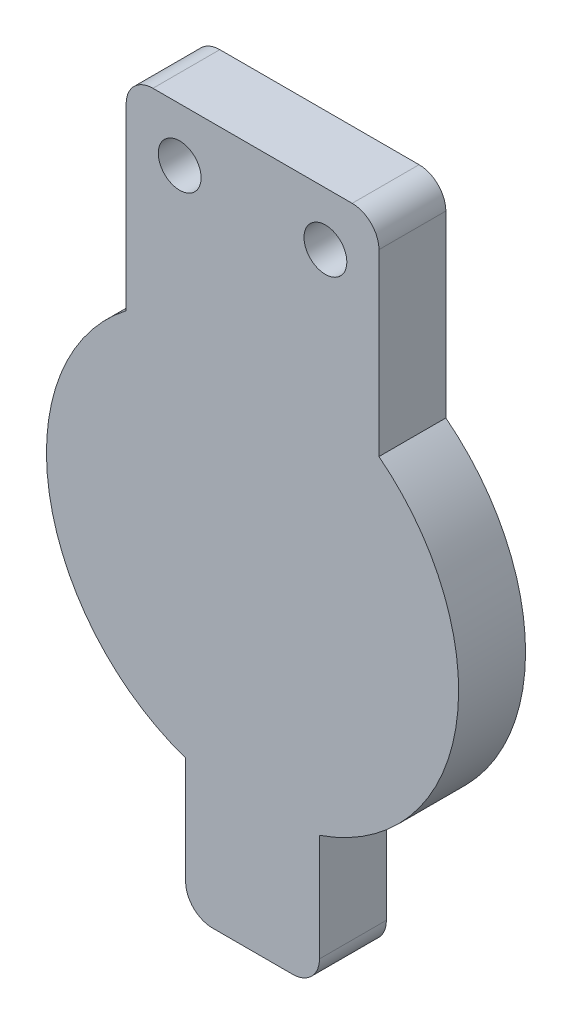
ISO-10303-21;
HEADER;
FILE_DESCRIPTION(('STEP AP214'),'2;1');
FILE_NAME('part.step','',(''),(''),'','','');
FILE_SCHEMA(('AUTOMOTIVE_DESIGN { 1 0 10303 214 1 1 1 1 }'));
ENDSEC;
DATA;
#1=APPLICATION_CONTEXT('core data for automotive mechanical design processes');
#2=APPLICATION_PROTOCOL_DEFINITION('international standard','automotive_design',2000,#1);
#3=PRODUCT_CONTEXT('',#1,'mechanical');
#4=PRODUCT('Part','Part','',(#3));
#5=PRODUCT_RELATED_PRODUCT_CATEGORY('part','',(#4));
#6=PRODUCT_DEFINITION_FORMATION('','',#4);
#7=PRODUCT_DEFINITION_CONTEXT('part definition',#1,'design');
#8=PRODUCT_DEFINITION('design','',#6,#7);
#9=PRODUCT_DEFINITION_SHAPE('','',#8);
#10=(LENGTH_UNIT() NAMED_UNIT(*) SI_UNIT(.MILLI.,.METRE.));
#11=(NAMED_UNIT(*) PLANE_ANGLE_UNIT() SI_UNIT($,.RADIAN.));
#12=(NAMED_UNIT(*) SI_UNIT($,.STERADIAN.) SOLID_ANGLE_UNIT());
#13=UNCERTAINTY_MEASURE_WITH_UNIT(LENGTH_MEASURE(1.E-05),#10,'distance_accuracy_value','');
#14=(GEOMETRIC_REPRESENTATION_CONTEXT(3) GLOBAL_UNCERTAINTY_ASSIGNED_CONTEXT((#13)) GLOBAL_UNIT_ASSIGNED_CONTEXT((#10,
#11,#12)) REPRESENTATION_CONTEXT('',''));
#15=CARTESIAN_POINT('',(0.,0.,0.));
#16=DIRECTION('',(0.,0.,1.));
#17=DIRECTION('',(1.,0.,0.));
#18=AXIS2_PLACEMENT_3D('',#15,#16,#17);
#19=CARTESIAN_POINT('',(6.35,0.,6.35));
#20=DIRECTION('',(-1.,0.,0.));
#21=DIRECTION('',(0.,-1.,0.));
#22=AXIS2_PLACEMENT_3D('',#19,#20,#21);
#23=PLANE('',#22);
#24=DIRECTION('',(0.,1.,0.));
#25=VECTOR('',#24,1.);
#26=CARTESIAN_POINT('',(6.35,0.,6.35));
#27=LINE('',#26,#25);
#28=CARTESIAN_POINT('',(6.35,-28.6584557193297,6.35));
#29=VERTEX_POINT('',#28);
#30=CARTESIAN_POINT('',(6.35,-18.4984557193297,6.35));
#31=VERTEX_POINT('',#30);
#32=EDGE_CURVE('E124',#29,#31,#27,.T.);
#33=ORIENTED_EDGE('',*,*,#32,.F.);
#34=DIRECTION('',(0.,0.,-1.));
#35=VECTOR('',#34,1.);
#36=CARTESIAN_POINT('',(6.35,-28.6584557193297,6.35));
#37=LINE('',#36,#35);
#38=CARTESIAN_POINT('',(6.35,-28.6584557193297,0.));
#39=VERTEX_POINT('',#38);
#40=EDGE_CURVE('E11',#29,#39,#37,.T.);
#41=ORIENTED_EDGE('',*,*,#40,.T.);
#42=DIRECTION('',(0.,1.,0.));
#43=VECTOR('',#42,1.);
#44=CARTESIAN_POINT('',(6.35,0.,0.));
#45=LINE('',#44,#43);
#46=CARTESIAN_POINT('',(6.35,-18.4984557193297,0.));
#47=VERTEX_POINT('',#46);
#48=EDGE_CURVE('E150',#39,#47,#45,.T.);
#49=ORIENTED_EDGE('',*,*,#48,.T.);
#50=DIRECTION('',(0.,0.,-1.));
#51=VECTOR('',#50,1.);
#52=CARTESIAN_POINT('',(6.35,-18.4984557193297,6.35));
#53=LINE('',#52,#51);
#54=EDGE_CURVE('E143',#31,#47,#53,.T.);
#55=ORIENTED_EDGE('',*,*,#54,.F.);
#56=EDGE_LOOP('',(#33,#41,#49,#55));
#57=FACE_BOUND('',#56,.T.);
#58=ADVANCED_FACE('F34',(#57),#23,.F.);
#59=CARTESIAN_POINT('',(0.,0.,6.35));
#60=DIRECTION('',(0.,0.,-1.));
#61=DIRECTION('',(-1.,0.,0.));
#62=AXIS2_PLACEMENT_3D('',#59,#60,#61);
#63=CYLINDRICAL_SURFACE('',#62,19.558);
#64=CARTESIAN_POINT('',(0.,0.,0.));
#65=DIRECTION('',(0.,0.,1.));
#66=DIRECTION('',(1.,0.,0.));
#67=AXIS2_PLACEMENT_3D('',#64,#65,#66);
#68=CIRCLE('',#67,19.558);
#69=CARTESIAN_POINT('',(11.9947972132232,15.4479838106354,0.));
#70=VERTEX_POINT('',#69);
#71=EDGE_CURVE('E228',#47,#70,#68,.T.);
#72=ORIENTED_EDGE('',*,*,#71,.T.);
#73=DIRECTION('',(0.,0.,-1.));
#74=VECTOR('',#73,1.);
#75=CARTESIAN_POINT('',(11.9947972132232,15.4479838106354,6.35));
#76=LINE('',#75,#74);
#77=CARTESIAN_POINT('',(11.9947972132232,15.4479838106354,6.35));
#78=VERTEX_POINT('',#77);
#79=EDGE_CURVE('E145',#78,#70,#76,.T.);
#80=ORIENTED_EDGE('',*,*,#79,.F.);
#81=CARTESIAN_POINT('',(0.,0.,6.35));
#82=DIRECTION('',(0.,0.,1.));
#83=DIRECTION('',(1.,0.,0.));
#84=AXIS2_PLACEMENT_3D('',#81,#82,#83);
#85=CIRCLE('',#84,19.558);
#86=EDGE_CURVE('E130',#31,#78,#85,.T.);
#87=ORIENTED_EDGE('',*,*,#86,.F.);
#88=ORIENTED_EDGE('',*,*,#54,.T.);
#89=EDGE_LOOP('',(#72,#80,#87,#88));
#90=FACE_BOUND('',#89,.T.);
#91=ADVANCED_FACE('F142',(#90),#63,.T.);
#92=CARTESIAN_POINT('',(11.9947972132232,0.,6.35));
#93=DIRECTION('',(1.,0.,0.));
#94=DIRECTION('',(0.,1.,0.));
#95=AXIS2_PLACEMENT_3D('',#92,#93,#94);
#96=PLANE('',#95);
#97=DIRECTION('',(0.,-1.,0.));
#98=VECTOR('',#97,1.);
#99=CARTESIAN_POINT('',(11.9947972132232,0.,0.));
#100=LINE('',#99,#98);
#101=CARTESIAN_POINT('',(11.9947972132232,32.4550501327767,0.));
#102=VERTEX_POINT('',#101);
#103=EDGE_CURVE('E233',#102,#70,#100,.T.);
#104=ORIENTED_EDGE('',*,*,#103,.F.);
#105=DIRECTION('',(0.,0.,-1.));
#106=VECTOR('',#105,1.);
#107=CARTESIAN_POINT('',(11.9947972132232,32.4550501327767,6.35));
#108=LINE('',#107,#106);
#109=CARTESIAN_POINT('',(11.9947972132232,32.4550501327767,6.35));
#110=VERTEX_POINT('',#109);
#111=EDGE_CURVE('E179',#102,#110,#108,.F.);
#112=ORIENTED_EDGE('',*,*,#111,.T.);
#113=DIRECTION('',(0.,-1.,0.));
#114=VECTOR('',#113,1.);
#115=CARTESIAN_POINT('',(11.9947972132232,0.,6.35));
#116=LINE('',#115,#114);
#117=EDGE_CURVE('E146',#110,#78,#116,.T.);
#118=ORIENTED_EDGE('',*,*,#117,.T.);
#119=ORIENTED_EDGE('',*,*,#79,.T.);
#120=EDGE_LOOP('',(#104,#112,#118,#119));
#121=FACE_BOUND('',#120,.T.);
#122=ADVANCED_FACE('F251',(#121),#96,.T.);
#123=CARTESIAN_POINT('',(0.,34.9950501327767,6.35));
#124=DIRECTION('',(0.,1.,0.));
#125=DIRECTION('',(0.,0.,1.));
#126=AXIS2_PLACEMENT_3D('',#123,#124,#125);
#127=PLANE('',#126);
#128=DIRECTION('',(1.,0.,0.));
#129=VECTOR('',#128,1.);
#130=CARTESIAN_POINT('',(0.,34.9950501327767,0.));
#131=LINE('',#130,#129);
#132=CARTESIAN_POINT('',(-9.45479721322323,34.9950501327767,0.));
#133=VERTEX_POINT('',#132);
#134=CARTESIAN_POINT('',(9.45479721322323,34.9950501327767,0.));
#135=VERTEX_POINT('',#134);
#136=EDGE_CURVE('E231',#133,#135,#131,.T.);
#137=ORIENTED_EDGE('',*,*,#136,.F.);
#138=DIRECTION('',(0.,0.,-1.));
#139=VECTOR('',#138,1.);
#140=CARTESIAN_POINT('',(-9.45479721322323,34.9950501327767,6.35));
#141=LINE('',#140,#139);
#142=CARTESIAN_POINT('',(-9.45479721322323,34.9950501327767,6.35));
#143=VERTEX_POINT('',#142);
#144=EDGE_CURVE('E171',#133,#143,#141,.F.);
#145=ORIENTED_EDGE('',*,*,#144,.T.);
#146=DIRECTION('',(1.,0.,0.));
#147=VECTOR('',#146,1.);
#148=CARTESIAN_POINT('',(0.,34.9950501327767,6.35));
#149=LINE('',#148,#147);
#150=CARTESIAN_POINT('',(9.45479721322323,34.9950501327767,6.35));
#151=VERTEX_POINT('',#150);
#152=EDGE_CURVE('E246',#143,#151,#149,.T.);
#153=ORIENTED_EDGE('',*,*,#152,.T.);
#154=DIRECTION('',(0.,0.,-1.));
#155=VECTOR('',#154,1.);
#156=CARTESIAN_POINT('',(9.45479721322323,34.9950501327767,6.35));
#157=LINE('',#156,#155);
#158=EDGE_CURVE('E168',#151,#135,#157,.T.);
#159=ORIENTED_EDGE('',*,*,#158,.T.);
#160=EDGE_LOOP('',(#137,#145,#153,#159));
#161=FACE_BOUND('',#160,.T.);
#162=ADVANCED_FACE('F259',(#161),#127,.T.);
#163=CARTESIAN_POINT('',(-11.9947972132232,0.,6.35));
#164=DIRECTION('',(-1.,0.,0.));
#165=DIRECTION('',(0.,-1.,0.));
#166=AXIS2_PLACEMENT_3D('',#163,#164,#165);
#167=PLANE('',#166);
#168=DIRECTION('',(0.,1.,0.));
#169=VECTOR('',#168,1.);
#170=CARTESIAN_POINT('',(-11.9947972132232,0.,6.35));
#171=LINE('',#170,#169);
#172=CARTESIAN_POINT('',(-11.9947972132232,15.4479838106354,6.35));
#173=VERTEX_POINT('',#172);
#174=CARTESIAN_POINT('',(-11.9947972132232,32.4550501327767,6.35));
#175=VERTEX_POINT('',#174);
#176=EDGE_CURVE('E244',#173,#175,#171,.T.);
#177=ORIENTED_EDGE('',*,*,#176,.T.);
#178=DIRECTION('',(0.,0.,-1.));
#179=VECTOR('',#178,1.);
#180=CARTESIAN_POINT('',(-11.9947972132232,32.4550501327767,6.35));
#181=LINE('',#180,#179);
#182=CARTESIAN_POINT('',(-11.9947972132232,32.4550501327767,0.));
#183=VERTEX_POINT('',#182);
#184=EDGE_CURVE('E152',#175,#183,#181,.T.);
#185=ORIENTED_EDGE('',*,*,#184,.T.);
#186=DIRECTION('',(0.,1.,0.));
#187=VECTOR('',#186,1.);
#188=CARTESIAN_POINT('',(-11.9947972132232,0.,0.));
#189=LINE('',#188,#187);
#190=CARTESIAN_POINT('',(-11.9947972132232,15.4479838106354,0.));
#191=VERTEX_POINT('',#190);
#192=EDGE_CURVE('E226',#191,#183,#189,.T.);
#193=ORIENTED_EDGE('',*,*,#192,.F.);
#194=DIRECTION('',(0.,0.,-1.));
#195=VECTOR('',#194,1.);
#196=CARTESIAN_POINT('',(-11.9947972132232,15.4479838106354,6.35));
#197=LINE('',#196,#195);
#198=EDGE_CURVE('E157',#173,#191,#197,.T.);
#199=ORIENTED_EDGE('',*,*,#198,.F.);
#200=EDGE_LOOP('',(#177,#185,#193,#199));
#201=FACE_BOUND('',#200,.T.);
#202=ADVANCED_FACE('F229',(#201),#167,.T.);
#203=CARTESIAN_POINT('',(-6.35,-18.4984557193297,0.));
#204=VERTEX_POINT('',#203);
#205=EDGE_CURVE('E212',#191,#204,#68,.T.);
#206=ORIENTED_EDGE('',*,*,#205,.T.);
#207=DIRECTION('',(0.,0.,-1.));
#208=VECTOR('',#207,1.);
#209=CARTESIAN_POINT('',(-6.35,-18.4984557193297,6.35));
#210=LINE('',#209,#208);
#211=CARTESIAN_POINT('',(-6.35,-18.4984557193297,6.35));
#212=VERTEX_POINT('',#211);
#213=EDGE_CURVE('E218',#212,#204,#210,.T.);
#214=ORIENTED_EDGE('',*,*,#213,.F.);
#215=EDGE_CURVE('E148',#173,#212,#85,.T.);
#216=ORIENTED_EDGE('',*,*,#215,.F.);
#217=ORIENTED_EDGE('',*,*,#198,.T.);
#218=EDGE_LOOP('',(#206,#214,#216,#217));
#219=FACE_BOUND('',#218,.T.);
#220=ADVANCED_FACE('F222',(#219),#63,.T.);
#221=CARTESIAN_POINT('',(-6.35,0.,6.35));
#222=DIRECTION('',(1.,0.,0.));
#223=DIRECTION('',(0.,0.,-1.));
#224=AXIS2_PLACEMENT_3D('',#221,#222,#223);
#225=PLANE('',#224);
#226=DIRECTION('',(0.,-1.,0.));
#227=VECTOR('',#226,1.);
#228=CARTESIAN_POINT('',(-6.35,0.,0.));
#229=LINE('',#228,#227);
#230=CARTESIAN_POINT('',(-6.35,-28.6584557193297,0.));
#231=VERTEX_POINT('',#230);
#232=EDGE_CURVE('E192',#204,#231,#229,.T.);
#233=ORIENTED_EDGE('',*,*,#232,.T.);
#234=DIRECTION('',(0.,0.,-1.));
#235=VECTOR('',#234,1.);
#236=CARTESIAN_POINT('',(-6.35,-28.6584557193297,6.35));
#237=LINE('',#236,#235);
#238=CARTESIAN_POINT('',(-6.35,-28.6584557193297,6.35));
#239=VERTEX_POINT('',#238);
#240=EDGE_CURVE('E42',#231,#239,#237,.F.);
#241=ORIENTED_EDGE('',*,*,#240,.T.);
#242=DIRECTION('',(0.,-1.,0.));
#243=VECTOR('',#242,1.);
#244=CARTESIAN_POINT('',(-6.35,0.,6.35));
#245=LINE('',#244,#243);
#246=EDGE_CURVE('E190',#212,#239,#245,.T.);
#247=ORIENTED_EDGE('',*,*,#246,.F.);
#248=ORIENTED_EDGE('',*,*,#213,.T.);
#249=EDGE_LOOP('',(#233,#241,#247,#248));
#250=FACE_BOUND('',#249,.T.);
#251=ADVANCED_FACE('F188',(#250),#225,.F.);
#252=CARTESIAN_POINT('',(6.91479721322323,29.9150501327767,6.35));
#253=DIRECTION('',(0.,0.,-1.));
#254=DIRECTION('',(-1.,0.,0.));
#255=AXIS2_PLACEMENT_3D('',#252,#253,#254);
#256=CYLINDRICAL_SURFACE('',#255,2.03200000000008);
#257=CARTESIAN_POINT('',(6.91479721322323,29.9150501327767,6.35));
#258=DIRECTION('',(0.,0.,1.));
#259=DIRECTION('',(1.,0.,0.));
#260=AXIS2_PLACEMENT_3D('',#257,#258,#259);
#261=CIRCLE('',#260,2.03200000000008);
#262=CARTESIAN_POINT('',(8.94679721322331,29.9150501327767,6.35));
#263=VERTEX_POINT('',#262);
#264=EDGE_CURVE('E240',#263,#263,#261,.T.);
#265=ORIENTED_EDGE('',*,*,#264,.T.);
#266=EDGE_LOOP('',(#265));
#267=FACE_BOUND('',#266,.T.);
#268=CARTESIAN_POINT('',(6.91479721322323,29.9150501327767,0.));
#269=DIRECTION('',(0.,0.,1.));
#270=DIRECTION('',(1.,0.,0.));
#271=AXIS2_PLACEMENT_3D('',#268,#269,#270);
#272=CIRCLE('',#271,2.03200000000008);
#273=CARTESIAN_POINT('',(8.94679721322331,29.9150501327767,0.));
#274=VERTEX_POINT('',#273);
#275=EDGE_CURVE('E208',#274,#274,#272,.T.);
#276=ORIENTED_EDGE('',*,*,#275,.F.);
#277=EDGE_LOOP('',(#276));
#278=FACE_BOUND('',#277,.T.);
#279=ADVANCED_FACE('F288',(#267,#278),#256,.F.);
#280=CARTESIAN_POINT('',(0.,-31.1984557193297,6.35));
#281=DIRECTION('',(0.,1.,0.));
#282=DIRECTION('',(0.,0.,1.));
#283=AXIS2_PLACEMENT_3D('',#280,#281,#282);
#284=PLANE('',#283);
#285=DIRECTION('',(1.,0.,0.));
#286=VECTOR('',#285,1.);
#287=CARTESIAN_POINT('',(0.,-31.1984557193297,6.35));
#288=LINE('',#287,#286);
#289=CARTESIAN_POINT('',(-3.81,-31.1984557193297,6.35));
#290=VERTEX_POINT('',#289);
#291=CARTESIAN_POINT('',(3.81,-31.1984557193297,6.35));
#292=VERTEX_POINT('',#291);
#293=EDGE_CURVE('E197',#290,#292,#288,.T.);
#294=ORIENTED_EDGE('',*,*,#293,.F.);
#295=DIRECTION('',(0.,0.,-1.));
#296=VECTOR('',#295,1.);
#297=CARTESIAN_POINT('',(-3.81,-31.1984557193297,6.35));
#298=LINE('',#297,#296);
#299=CARTESIAN_POINT('',(-3.81,-31.1984557193297,0.));
#300=VERTEX_POINT('',#299);
#301=EDGE_CURVE('E182',#290,#300,#298,.T.);
#302=ORIENTED_EDGE('',*,*,#301,.T.);
#303=DIRECTION('',(1.,0.,0.));
#304=VECTOR('',#303,1.);
#305=CARTESIAN_POINT('',(0.,-31.1984557193297,0.));
#306=LINE('',#305,#304);
#307=CARTESIAN_POINT('',(3.81,-31.1984557193297,0.));
#308=VERTEX_POINT('',#307);
#309=EDGE_CURVE('E203',#300,#308,#306,.T.);
#310=ORIENTED_EDGE('',*,*,#309,.T.);
#311=DIRECTION('',(0.,0.,-1.));
#312=VECTOR('',#311,1.);
#313=CARTESIAN_POINT('',(3.81,-31.1984557193297,6.35));
#314=LINE('',#313,#312);
#315=EDGE_CURVE('E49',#308,#292,#314,.F.);
#316=ORIENTED_EDGE('',*,*,#315,.T.);
#317=EDGE_LOOP('',(#294,#302,#310,#316));
#318=FACE_BOUND('',#317,.T.);
#319=ADVANCED_FACE('F202',(#318),#284,.F.);
#320=CARTESIAN_POINT('',(-6.91479721322323,29.9150501327767,6.35));
#321=DIRECTION('',(0.,0.,-1.));
#322=DIRECTION('',(-1.,0.,0.));
#323=AXIS2_PLACEMENT_3D('',#320,#321,#322);
#324=CYLINDRICAL_SURFACE('',#323,2.032);
#325=CARTESIAN_POINT('',(-6.91479721322323,29.9150501327767,6.35));
#326=DIRECTION('',(0.,0.,1.));
#327=DIRECTION('',(1.,0.,0.));
#328=AXIS2_PLACEMENT_3D('',#325,#326,#327);
#329=CIRCLE('',#328,2.032);
#330=CARTESIAN_POINT('',(-4.88279721322323,29.9150501327767,6.35));
#331=VERTEX_POINT('',#330);
#332=EDGE_CURVE('E219',#331,#331,#329,.F.);
#333=ORIENTED_EDGE('',*,*,#332,.F.);
#334=EDGE_LOOP('',(#333));
#335=FACE_BOUND('',#334,.T.);
#336=CARTESIAN_POINT('',(-6.91479721322323,29.9150501327767,0.));
#337=DIRECTION('',(0.,0.,1.));
#338=DIRECTION('',(1.,0.,0.));
#339=AXIS2_PLACEMENT_3D('',#336,#337,#338);
#340=CIRCLE('',#339,2.032);
#341=CARTESIAN_POINT('',(-4.88279721322323,29.9150501327767,0.));
#342=VERTEX_POINT('',#341);
#343=EDGE_CURVE('E137',#342,#342,#340,.F.);
#344=ORIENTED_EDGE('',*,*,#343,.T.);
#345=EDGE_LOOP('',(#344));
#346=FACE_BOUND('',#345,.T.);
#347=ADVANCED_FACE('F291',(#335,#346),#324,.F.);
#348=CARTESIAN_POINT('',(0.,0.,6.35));
#349=DIRECTION('',(0.,0.,1.));
#350=DIRECTION('',(1.,0.,0.));
#351=AXIS2_PLACEMENT_3D('',#348,#349,#350);
#352=PLANE('',#351);
#353=ORIENTED_EDGE('',*,*,#152,.F.);
#354=CARTESIAN_POINT('',(-9.45479721322323,32.4550501327767,6.35));
#355=DIRECTION('',(0.,0.,1.));
#356=DIRECTION('',(1.,0.,0.));
#357=AXIS2_PLACEMENT_3D('',#354,#355,#356);
#358=CIRCLE('',#357,2.54);
#359=EDGE_CURVE('E177',#143,#175,#358,.T.);
#360=ORIENTED_EDGE('',*,*,#359,.T.);
#361=ORIENTED_EDGE('',*,*,#176,.F.);
#362=ORIENTED_EDGE('',*,*,#215,.T.);
#363=ORIENTED_EDGE('',*,*,#246,.T.);
#364=CARTESIAN_POINT('',(-3.81,-28.6584557193297,6.35));
#365=DIRECTION('',(0.,0.,1.));
#366=DIRECTION('',(1.,0.,0.));
#367=AXIS2_PLACEMENT_3D('',#364,#365,#366);
#368=CIRCLE('',#367,2.54);
#369=EDGE_CURVE('E56',#239,#290,#368,.T.);
#370=ORIENTED_EDGE('',*,*,#369,.T.);
#371=ORIENTED_EDGE('',*,*,#293,.T.);
#372=CARTESIAN_POINT('',(3.81,-28.6584557193297,6.35));
#373=DIRECTION('',(0.,0.,1.));
#374=DIRECTION('',(1.,0.,0.));
#375=AXIS2_PLACEMENT_3D('',#372,#373,#374);
#376=CIRCLE('',#375,2.54);
#377=EDGE_CURVE('E133',#292,#29,#376,.T.);
#378=ORIENTED_EDGE('',*,*,#377,.T.);
#379=ORIENTED_EDGE('',*,*,#32,.T.);
#380=ORIENTED_EDGE('',*,*,#86,.T.);
#381=ORIENTED_EDGE('',*,*,#117,.F.);
#382=CARTESIAN_POINT('',(9.45479721322323,32.4550501327767,6.35));
#383=DIRECTION('',(0.,0.,1.));
#384=DIRECTION('',(1.,0.,0.));
#385=AXIS2_PLACEMENT_3D('',#382,#383,#384);
#386=CIRCLE('',#385,2.54);
#387=EDGE_CURVE('E175',#110,#151,#386,.T.);
#388=ORIENTED_EDGE('',*,*,#387,.T.);
#389=EDGE_LOOP('',(#353,#360,#361,#362,#363,#370,#371,#378,#379,#380,#381,#388));
#390=FACE_BOUND('',#389,.T.);
#391=ORIENTED_EDGE('',*,*,#264,.F.);
#392=EDGE_LOOP('',(#391));
#393=FACE_BOUND('',#392,.T.);
#394=ORIENTED_EDGE('',*,*,#332,.T.);
#395=EDGE_LOOP('',(#394));
#396=FACE_BOUND('',#395,.T.);
#397=ADVANCED_FACE('F127',(#390,#393,#396),#352,.T.);
#398=CARTESIAN_POINT('',(0.,0.,0.));
#399=DIRECTION('',(0.,0.,1.));
#400=DIRECTION('',(1.,0.,0.));
#401=AXIS2_PLACEMENT_3D('',#398,#399,#400);
#402=PLANE('',#401);
#403=ORIENTED_EDGE('',*,*,#192,.T.);
#404=CARTESIAN_POINT('',(-9.45479721322323,32.4550501327767,0.));
#405=DIRECTION('',(0.,0.,1.));
#406=DIRECTION('',(1.,0.,0.));
#407=AXIS2_PLACEMENT_3D('',#404,#405,#406);
#408=CIRCLE('',#407,2.54);
#409=EDGE_CURVE('E166',#183,#133,#408,.F.);
#410=ORIENTED_EDGE('',*,*,#409,.T.);
#411=ORIENTED_EDGE('',*,*,#136,.T.);
#412=CARTESIAN_POINT('',(9.45479721322323,32.4550501327767,0.));
#413=DIRECTION('',(0.,0.,1.));
#414=DIRECTION('',(1.,0.,0.));
#415=AXIS2_PLACEMENT_3D('',#412,#413,#414);
#416=CIRCLE('',#415,2.54);
#417=EDGE_CURVE('E164',#135,#102,#416,.F.);
#418=ORIENTED_EDGE('',*,*,#417,.T.);
#419=ORIENTED_EDGE('',*,*,#103,.T.);
#420=ORIENTED_EDGE('',*,*,#71,.F.);
#421=ORIENTED_EDGE('',*,*,#48,.F.);
#422=CARTESIAN_POINT('',(3.81,-28.6584557193297,0.));
#423=DIRECTION('',(0.,0.,1.));
#424=DIRECTION('',(1.,0.,0.));
#425=AXIS2_PLACEMENT_3D('',#422,#423,#424);
#426=CIRCLE('',#425,2.54);
#427=EDGE_CURVE('E155',#39,#308,#426,.F.);
#428=ORIENTED_EDGE('',*,*,#427,.T.);
#429=ORIENTED_EDGE('',*,*,#309,.F.);
#430=CARTESIAN_POINT('',(-3.81,-28.6584557193297,0.));
#431=DIRECTION('',(0.,0.,1.));
#432=DIRECTION('',(1.,0.,0.));
#433=AXIS2_PLACEMENT_3D('',#430,#431,#432);
#434=CIRCLE('',#433,2.54);
#435=EDGE_CURVE('E162',#300,#231,#434,.F.);
#436=ORIENTED_EDGE('',*,*,#435,.T.);
#437=ORIENTED_EDGE('',*,*,#232,.F.);
#438=ORIENTED_EDGE('',*,*,#205,.F.);
#439=EDGE_LOOP('',(#403,#410,#411,#418,#419,#420,#421,#428,#429,#436,#437,#438));
#440=FACE_BOUND('',#439,.T.);
#441=ORIENTED_EDGE('',*,*,#275,.T.);
#442=EDGE_LOOP('',(#441));
#443=FACE_BOUND('',#442,.T.);
#444=ORIENTED_EDGE('',*,*,#343,.F.);
#445=EDGE_LOOP('',(#444));
#446=FACE_BOUND('',#445,.T.);
#447=ADVANCED_FACE('F206',(#440,#443,#446),#402,.F.);
#448=CARTESIAN_POINT('',(-9.45479721322323,32.4550501327767,6.35));
#449=DIRECTION('',(0.,0.,-1.));
#450=DIRECTION('',(-1.,0.,0.));
#451=AXIS2_PLACEMENT_3D('',#448,#449,#450);
#452=CYLINDRICAL_SURFACE('',#451,2.54);
#453=ORIENTED_EDGE('',*,*,#359,.F.);
#454=ORIENTED_EDGE('',*,*,#144,.F.);
#455=ORIENTED_EDGE('',*,*,#409,.F.);
#456=ORIENTED_EDGE('',*,*,#184,.F.);
#457=EDGE_LOOP('',(#453,#454,#455,#456));
#458=FACE_BOUND('',#457,.T.);
#459=ADVANCED_FACE('F263',(#458),#452,.T.);
#460=CARTESIAN_POINT('',(9.45479721322323,32.4550501327767,6.35));
#461=DIRECTION('',(0.,0.,-1.));
#462=DIRECTION('',(-1.,0.,0.));
#463=AXIS2_PLACEMENT_3D('',#460,#461,#462);
#464=CYLINDRICAL_SURFACE('',#463,2.54);
#465=ORIENTED_EDGE('',*,*,#387,.F.);
#466=ORIENTED_EDGE('',*,*,#111,.F.);
#467=ORIENTED_EDGE('',*,*,#417,.F.);
#468=ORIENTED_EDGE('',*,*,#158,.F.);
#469=EDGE_LOOP('',(#465,#466,#467,#468));
#470=FACE_BOUND('',#469,.T.);
#471=ADVANCED_FACE('F256',(#470),#464,.T.);
#472=CARTESIAN_POINT('',(-3.81,-28.6584557193297,6.35));
#473=DIRECTION('',(0.,0.,-1.));
#474=DIRECTION('',(-1.,0.,0.));
#475=AXIS2_PLACEMENT_3D('',#472,#473,#474);
#476=CYLINDRICAL_SURFACE('',#475,2.54);
#477=ORIENTED_EDGE('',*,*,#369,.F.);
#478=ORIENTED_EDGE('',*,*,#240,.F.);
#479=ORIENTED_EDGE('',*,*,#435,.F.);
#480=ORIENTED_EDGE('',*,*,#301,.F.);
#481=EDGE_LOOP('',(#477,#478,#479,#480));
#482=FACE_BOUND('',#481,.T.);
#483=ADVANCED_FACE('F200',(#482),#476,.T.);
#484=CARTESIAN_POINT('',(3.81,-28.6584557193297,6.35));
#485=DIRECTION('',(0.,0.,-1.));
#486=DIRECTION('',(-1.,0.,0.));
#487=AXIS2_PLACEMENT_3D('',#484,#485,#486);
#488=CYLINDRICAL_SURFACE('',#487,2.54);
#489=ORIENTED_EDGE('',*,*,#377,.F.);
#490=ORIENTED_EDGE('',*,*,#315,.F.);
#491=ORIENTED_EDGE('',*,*,#427,.F.);
#492=ORIENTED_EDGE('',*,*,#40,.F.);
#493=EDGE_LOOP('',(#489,#490,#491,#492));
#494=FACE_BOUND('',#493,.T.);
#495=ADVANCED_FACE('F36',(#494),#488,.T.);
#496=CLOSED_SHELL('',(#58,#91,#122,#162,#202,#220,#251,#279,#319,#347,#397,#447,#459,#471,#483,#495));
#497=MANIFOLD_SOLID_BREP('B2',#496);
#498=ADVANCED_BREP_SHAPE_REPRESENTATION('',(#18,#497),#14);
#499=SHAPE_DEFINITION_REPRESENTATION(#9,#498);
ENDSEC;
END-ISO-10303-21;
